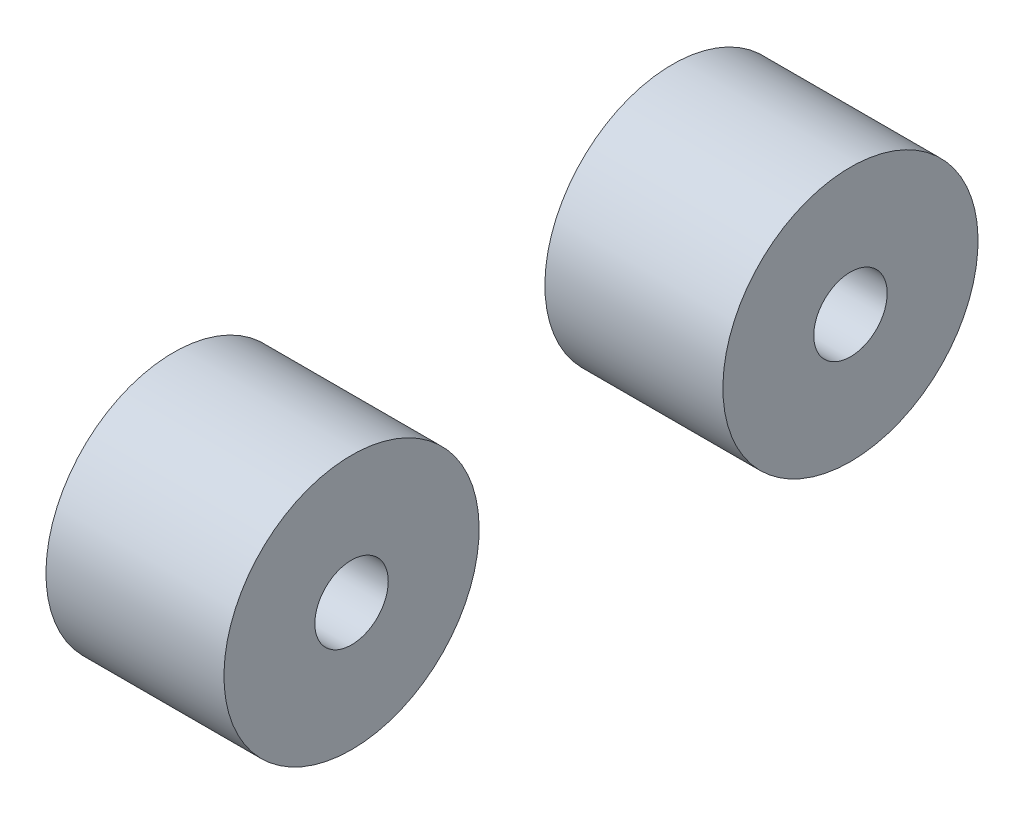
ISO-10303-21;
HEADER;
FILE_DESCRIPTION(('STEP AP214'),'2;1');
FILE_NAME('part.step','',(''),(''),'','','');
FILE_SCHEMA(('AUTOMOTIVE_DESIGN { 1 0 10303 214 1 1 1 1 }'));
ENDSEC;
DATA;
#1=APPLICATION_CONTEXT('core data for automotive mechanical design processes');
#2=APPLICATION_PROTOCOL_DEFINITION('international standard','automotive_design',2000,#1);
#3=PRODUCT_CONTEXT('',#1,'mechanical');
#4=PRODUCT('Part','Part','',(#3));
#5=PRODUCT_RELATED_PRODUCT_CATEGORY('part','',(#4));
#6=PRODUCT_DEFINITION_FORMATION('','',#4);
#7=PRODUCT_DEFINITION_CONTEXT('part definition',#1,'design');
#8=PRODUCT_DEFINITION('design','',#6,#7);
#9=PRODUCT_DEFINITION_SHAPE('','',#8);
#10=(LENGTH_UNIT() NAMED_UNIT(*) SI_UNIT(.MILLI.,.METRE.));
#11=(NAMED_UNIT(*) PLANE_ANGLE_UNIT() SI_UNIT($,.RADIAN.));
#12=(NAMED_UNIT(*) SI_UNIT($,.STERADIAN.) SOLID_ANGLE_UNIT());
#13=UNCERTAINTY_MEASURE_WITH_UNIT(LENGTH_MEASURE(1.E-05),#10,'distance_accuracy_value','');
#14=(GEOMETRIC_REPRESENTATION_CONTEXT(3) GLOBAL_UNCERTAINTY_ASSIGNED_CONTEXT((#13)) GLOBAL_UNIT_ASSIGNED_CONTEXT((#10,
#11,#12)) REPRESENTATION_CONTEXT('',''));
#15=CARTESIAN_POINT('',(0.,0.,0.));
#16=DIRECTION('',(0.,0.,1.));
#17=DIRECTION('',(1.,0.,0.));
#18=AXIS2_PLACEMENT_3D('',#15,#16,#17);
#19=CARTESIAN_POINT('',(8.255,0.,50.4527690620356));
#20=DIRECTION('',(1.,0.,0.));
#21=DIRECTION('',(0.,1.,0.));
#22=AXIS2_PLACEMENT_3D('',#19,#20,#21);
#23=PLANE('',#22);
#24=CARTESIAN_POINT('',(8.255,0.,50.4527690620356));
#25=DIRECTION('',(-1.,0.,0.));
#26=DIRECTION('',(0.,-1.,0.));
#27=AXIS2_PLACEMENT_3D('',#24,#25,#26);
#28=CIRCLE('',#27,3.71375);
#29=CARTESIAN_POINT('',(8.255,-3.71375,50.4527690620356));
#30=VERTEX_POINT('',#29);
#31=EDGE_CURVE('E61',#30,#30,#28,.T.);
#32=ORIENTED_EDGE('',*,*,#31,.F.);
#33=EDGE_LOOP('',(#32));
#34=FACE_BOUND('',#33,.T.);
#35=CARTESIAN_POINT('',(8.255,0.,50.4527690620356));
#36=DIRECTION('',(-1.,0.,0.));
#37=DIRECTION('',(0.,-1.,0.));
#38=AXIS2_PLACEMENT_3D('',#35,#36,#37);
#39=CIRCLE('',#38,12.9);
#40=CARTESIAN_POINT('',(8.255,-12.9,50.4527690620356));
#41=VERTEX_POINT('',#40);
#42=EDGE_CURVE('E11',#41,#41,#39,.T.);
#43=ORIENTED_EDGE('',*,*,#42,.T.);
#44=EDGE_LOOP('',(#43));
#45=FACE_BOUND('',#44,.T.);
#46=ADVANCED_FACE('F47',(#34,#45),#23,.F.);
#47=CARTESIAN_POINT('',(8.255,0.,50.4527690620356));
#48=DIRECTION('',(-1.,0.,0.));
#49=DIRECTION('',(0.,-1.,0.));
#50=AXIS2_PLACEMENT_3D('',#47,#48,#49);
#51=CYLINDRICAL_SURFACE('',#50,12.9);
#52=ORIENTED_EDGE('',*,*,#42,.F.);
#53=EDGE_LOOP('',(#52));
#54=FACE_BOUND('',#53,.T.);
#55=CARTESIAN_POINT('',(26.255,0.,50.4527690620356));
#56=DIRECTION('',(-1.,0.,0.));
#57=DIRECTION('',(0.,-1.,0.));
#58=AXIS2_PLACEMENT_3D('',#55,#56,#57);
#59=CIRCLE('',#58,12.9);
#60=CARTESIAN_POINT('',(26.255,-12.9,50.4527690620356));
#61=VERTEX_POINT('',#60);
#62=EDGE_CURVE('E53',#61,#61,#59,.T.);
#63=ORIENTED_EDGE('',*,*,#62,.T.);
#64=EDGE_LOOP('',(#63));
#65=FACE_BOUND('',#64,.T.);
#66=ADVANCED_FACE('F86',(#54,#65),#51,.T.);
#67=CARTESIAN_POINT('',(26.255,12.9,50.4527690620356));
#68=DIRECTION('',(-1.,0.,0.));
#69=DIRECTION('',(0.,-1.,0.));
#70=AXIS2_PLACEMENT_3D('',#67,#68,#69);
#71=PLANE('',#70);
#72=CARTESIAN_POINT('',(26.255,0.,50.4527690620356));
#73=DIRECTION('',(1.,0.,0.));
#74=DIRECTION('',(0.,0.,-1.));
#75=AXIS2_PLACEMENT_3D('',#72,#73,#74);
#76=CIRCLE('',#75,3.71375);
#77=CARTESIAN_POINT('',(26.255,0.,46.7390190620356));
#78=VERTEX_POINT('',#77);
#79=EDGE_CURVE('E67',#78,#78,#76,.T.);
#80=ORIENTED_EDGE('',*,*,#79,.F.);
#81=EDGE_LOOP('',(#80));
#82=FACE_BOUND('',#81,.T.);
#83=ORIENTED_EDGE('',*,*,#62,.F.);
#84=EDGE_LOOP('',(#83));
#85=FACE_BOUND('',#84,.T.);
#86=ADVANCED_FACE('F82',(#82,#85),#71,.F.);
#87=CARTESIAN_POINT('',(15.8275,0.,50.4527690620356));
#88=DIRECTION('',(-1.,0.,0.));
#89=DIRECTION('',(0.,-1.,0.));
#90=AXIS2_PLACEMENT_3D('',#87,#88,#89);
#91=CYLINDRICAL_SURFACE('',#90,3.71375);
#92=CARTESIAN_POINT('',(15.8275,0.,50.4527690620356));
#93=DIRECTION('',(-1.,0.,0.));
#94=DIRECTION('',(0.,-1.,0.));
#95=AXIS2_PLACEMENT_3D('',#92,#93,#94);
#96=CIRCLE('',#95,3.71375);
#97=CARTESIAN_POINT('',(15.8275,-3.71375,50.4527690620356));
#98=VERTEX_POINT('',#97);
#99=EDGE_CURVE('E57',#98,#98,#96,.T.);
#100=ORIENTED_EDGE('',*,*,#99,.F.);
#101=EDGE_LOOP('',(#100));
#102=FACE_BOUND('',#101,.T.);
#103=ORIENTED_EDGE('',*,*,#31,.T.);
#104=EDGE_LOOP('',(#103));
#105=FACE_BOUND('',#104,.T.);
#106=ADVANCED_FACE('F85',(#102,#105),#91,.F.);
#107=CARTESIAN_POINT('',(15.8275,0.,50.4527690620356));
#108=DIRECTION('',(-1.,0.,0.));
#109=DIRECTION('',(0.,-1.,0.));
#110=AXIS2_PLACEMENT_3D('',#107,#108,#109);
#111=PLANE('',#110);
#112=ORIENTED_EDGE('',*,*,#99,.T.);
#113=EDGE_LOOP('',(#112));
#114=FACE_BOUND('',#113,.T.);
#115=ADVANCED_FACE('F78',(#114),#111,.T.);
#116=CARTESIAN_POINT('',(19.1825,0.,50.4527690620356));
#117=DIRECTION('',(1.,0.,0.));
#118=DIRECTION('',(0.,0.,-1.));
#119=AXIS2_PLACEMENT_3D('',#116,#117,#118);
#120=CYLINDRICAL_SURFACE('',#119,3.71375);
#121=CARTESIAN_POINT('',(19.1825,0.,50.4527690620356));
#122=DIRECTION('',(1.,0.,0.));
#123=DIRECTION('',(0.,0.,-1.));
#124=AXIS2_PLACEMENT_3D('',#121,#122,#123);
#125=CIRCLE('',#124,3.71375);
#126=CARTESIAN_POINT('',(19.1825,0.,46.7390190620356));
#127=VERTEX_POINT('',#126);
#128=EDGE_CURVE('E65',#127,#127,#125,.T.);
#129=ORIENTED_EDGE('',*,*,#128,.F.);
#130=EDGE_LOOP('',(#129));
#131=FACE_BOUND('',#130,.T.);
#132=ORIENTED_EDGE('',*,*,#79,.T.);
#133=EDGE_LOOP('',(#132));
#134=FACE_BOUND('',#133,.T.);
#135=ADVANCED_FACE('F75',(#131,#134),#120,.F.);
#136=CARTESIAN_POINT('',(19.1825,0.,50.4527690620356));
#137=DIRECTION('',(1.,0.,0.));
#138=DIRECTION('',(0.,0.,-1.));
#139=AXIS2_PLACEMENT_3D('',#136,#137,#138);
#140=PLANE('',#139);
#141=ORIENTED_EDGE('',*,*,#128,.T.);
#142=EDGE_LOOP('',(#141));
#143=FACE_BOUND('',#142,.T.);
#144=ADVANCED_FACE('F73',(#143),#140,.T.);
#145=CLOSED_SHELL('',(#46,#66,#86,#106,#115,#135,#144));
#146=MANIFOLD_SOLID_BREP('B2_NOT_SHOWN',#145);
#147=CARTESIAN_POINT('',(8.255,0.,0.));
#148=DIRECTION('',(1.,0.,0.));
#149=DIRECTION('',(0.,1.,0.));
#150=AXIS2_PLACEMENT_3D('',#147,#148,#149);
#151=PLANE('',#150);
#152=CARTESIAN_POINT('',(8.255,0.,0.));
#153=DIRECTION('',(-1.,0.,0.));
#154=DIRECTION('',(0.,-1.,0.));
#155=AXIS2_PLACEMENT_3D('',#152,#153,#154);
#156=CIRCLE('',#155,3.71375);
#157=CARTESIAN_POINT('',(8.255,-3.71375,0.));
#158=VERTEX_POINT('',#157);
#159=EDGE_CURVE('E165',#158,#158,#156,.T.);
#160=ORIENTED_EDGE('',*,*,#159,.F.);
#161=EDGE_LOOP('',(#160));
#162=FACE_BOUND('',#161,.T.);
#163=CARTESIAN_POINT('',(8.255,0.,0.));
#164=DIRECTION('',(-1.,0.,0.));
#165=DIRECTION('',(0.,-1.,0.));
#166=AXIS2_PLACEMENT_3D('',#163,#164,#165);
#167=CIRCLE('',#166,12.9);
#168=CARTESIAN_POINT('',(8.255,-12.9,0.));
#169=VERTEX_POINT('',#168);
#170=EDGE_CURVE('E46',#169,#169,#167,.T.);
#171=ORIENTED_EDGE('',*,*,#170,.T.);
#172=EDGE_LOOP('',(#171));
#173=FACE_BOUND('',#172,.T.);
#174=ADVANCED_FACE('F148',(#162,#173),#151,.F.);
#175=CARTESIAN_POINT('',(8.255,0.,0.));
#176=DIRECTION('',(-1.,0.,0.));
#177=DIRECTION('',(0.,-1.,0.));
#178=AXIS2_PLACEMENT_3D('',#175,#176,#177);
#179=CYLINDRICAL_SURFACE('',#178,12.9);
#180=ORIENTED_EDGE('',*,*,#170,.F.);
#181=EDGE_LOOP('',(#180));
#182=FACE_BOUND('',#181,.T.);
#183=CARTESIAN_POINT('',(26.255,0.,0.));
#184=DIRECTION('',(-1.,0.,0.));
#185=DIRECTION('',(0.,-1.,0.));
#186=AXIS2_PLACEMENT_3D('',#183,#184,#185);
#187=CIRCLE('',#186,12.9);
#188=CARTESIAN_POINT('',(26.255,-12.9,0.));
#189=VERTEX_POINT('',#188);
#190=EDGE_CURVE('E155',#189,#189,#187,.T.);
#191=ORIENTED_EDGE('',*,*,#190,.T.);
#192=EDGE_LOOP('',(#191));
#193=FACE_BOUND('',#192,.T.);
#194=ADVANCED_FACE('F193',(#182,#193),#179,.T.);
#195=CARTESIAN_POINT('',(26.255,12.9,0.));
#196=DIRECTION('',(-1.,0.,0.));
#197=DIRECTION('',(0.,-1.,0.));
#198=AXIS2_PLACEMENT_3D('',#195,#196,#197);
#199=PLANE('',#198);
#200=CARTESIAN_POINT('',(26.255,0.,0.));
#201=DIRECTION('',(1.,0.,0.));
#202=DIRECTION('',(0.,0.,-1.));
#203=AXIS2_PLACEMENT_3D('',#200,#201,#202);
#204=CIRCLE('',#203,3.71375);
#205=CARTESIAN_POINT('',(26.255,0.,-3.71375));
#206=VERTEX_POINT('',#205);
#207=EDGE_CURVE('E172',#206,#206,#204,.T.);
#208=ORIENTED_EDGE('',*,*,#207,.F.);
#209=EDGE_LOOP('',(#208));
#210=FACE_BOUND('',#209,.T.);
#211=ORIENTED_EDGE('',*,*,#190,.F.);
#212=EDGE_LOOP('',(#211));
#213=FACE_BOUND('',#212,.T.);
#214=ADVANCED_FACE('F189',(#210,#213),#199,.F.);
#215=CARTESIAN_POINT('',(15.8275,0.,0.));
#216=DIRECTION('',(-1.,0.,0.));
#217=DIRECTION('',(0.,-1.,0.));
#218=AXIS2_PLACEMENT_3D('',#215,#216,#217);
#219=CYLINDRICAL_SURFACE('',#218,3.71375);
#220=CARTESIAN_POINT('',(15.8275,0.,0.));
#221=DIRECTION('',(-1.,0.,0.));
#222=DIRECTION('',(0.,-1.,0.));
#223=AXIS2_PLACEMENT_3D('',#220,#221,#222);
#224=CIRCLE('',#223,3.71375);
#225=CARTESIAN_POINT('',(15.8275,-3.71375,0.));
#226=VERTEX_POINT('',#225);
#227=EDGE_CURVE('E160',#226,#226,#224,.T.);
#228=ORIENTED_EDGE('',*,*,#227,.F.);
#229=EDGE_LOOP('',(#228));
#230=FACE_BOUND('',#229,.T.);
#231=ORIENTED_EDGE('',*,*,#159,.T.);
#232=EDGE_LOOP('',(#231));
#233=FACE_BOUND('',#232,.T.);
#234=ADVANCED_FACE('F192',(#230,#233),#219,.F.);
#235=CARTESIAN_POINT('',(15.8275,0.,0.));
#236=DIRECTION('',(-1.,0.,0.));
#237=DIRECTION('',(0.,-1.,0.));
#238=AXIS2_PLACEMENT_3D('',#235,#236,#237);
#239=PLANE('',#238);
#240=ORIENTED_EDGE('',*,*,#227,.T.);
#241=EDGE_LOOP('',(#240));
#242=FACE_BOUND('',#241,.T.);
#243=ADVANCED_FACE('F185',(#242),#239,.T.);
#244=CARTESIAN_POINT('',(19.1825,0.,0.));
#245=DIRECTION('',(1.,0.,0.));
#246=DIRECTION('',(0.,0.,-1.));
#247=AXIS2_PLACEMENT_3D('',#244,#245,#246);
#248=CYLINDRICAL_SURFACE('',#247,3.71375);
#249=CARTESIAN_POINT('',(19.1825,0.,0.));
#250=DIRECTION('',(1.,0.,0.));
#251=DIRECTION('',(0.,0.,-1.));
#252=AXIS2_PLACEMENT_3D('',#249,#250,#251);
#253=CIRCLE('',#252,3.71375);
#254=CARTESIAN_POINT('',(19.1825,0.,-3.71375));
#255=VERTEX_POINT('',#254);
#256=EDGE_CURVE('E170',#255,#255,#253,.T.);
#257=ORIENTED_EDGE('',*,*,#256,.F.);
#258=EDGE_LOOP('',(#257));
#259=FACE_BOUND('',#258,.T.);
#260=ORIENTED_EDGE('',*,*,#207,.T.);
#261=EDGE_LOOP('',(#260));
#262=FACE_BOUND('',#261,.T.);
#263=ADVANCED_FACE('F182',(#259,#262),#248,.F.);
#264=CARTESIAN_POINT('',(19.1825,0.,0.));
#265=DIRECTION('',(1.,0.,0.));
#266=DIRECTION('',(0.,0.,-1.));
#267=AXIS2_PLACEMENT_3D('',#264,#265,#266);
#268=PLANE('',#267);
#269=ORIENTED_EDGE('',*,*,#256,.T.);
#270=EDGE_LOOP('',(#269));
#271=FACE_BOUND('',#270,.T.);
#272=ADVANCED_FACE('F180',(#271),#268,.T.);
#273=CLOSED_SHELL('',(#174,#194,#214,#234,#243,#263,#272));
#274=MANIFOLD_SOLID_BREP('B6',#273);
#275=ADVANCED_BREP_SHAPE_REPRESENTATION('',(#18,#146,#274),#14);
#276=SHAPE_DEFINITION_REPRESENTATION(#9,#275);
ENDSEC;
END-ISO-10303-21;
